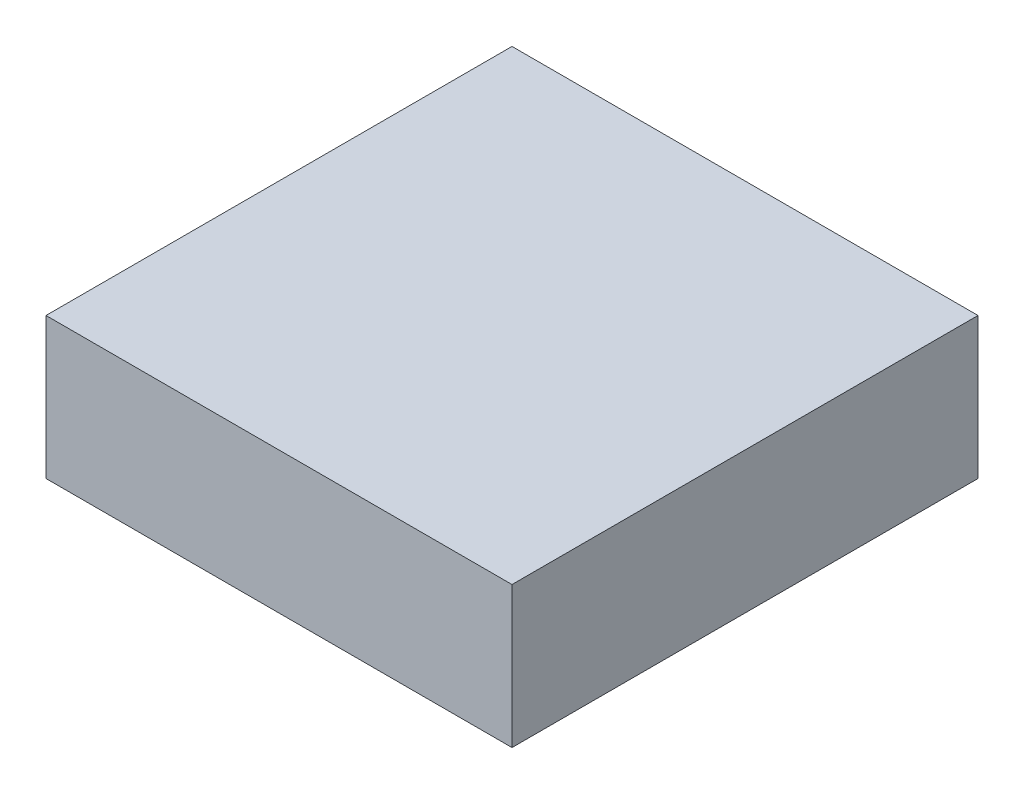
ISO-10303-21;
HEADER;
FILE_DESCRIPTION(('STEP AP214'),'2;1');
FILE_NAME('part.step','',(''),(''),'','','');
FILE_SCHEMA(('AUTOMOTIVE_DESIGN { 1 0 10303 214 1 1 1 1 }'));
ENDSEC;
DATA;
#1=APPLICATION_CONTEXT('core data for automotive mechanical design processes');
#2=APPLICATION_PROTOCOL_DEFINITION('international standard','automotive_design',2000,#1);
#3=PRODUCT_CONTEXT('',#1,'mechanical');
#4=PRODUCT('Part','Part','',(#3));
#5=PRODUCT_RELATED_PRODUCT_CATEGORY('part','',(#4));
#6=PRODUCT_DEFINITION_FORMATION('','',#4);
#7=PRODUCT_DEFINITION_CONTEXT('part definition',#1,'design');
#8=PRODUCT_DEFINITION('design','',#6,#7);
#9=PRODUCT_DEFINITION_SHAPE('','',#8);
#10=(LENGTH_UNIT() NAMED_UNIT(*) SI_UNIT(.MILLI.,.METRE.));
#11=(NAMED_UNIT(*) PLANE_ANGLE_UNIT() SI_UNIT($,.RADIAN.));
#12=(NAMED_UNIT(*) SI_UNIT($,.STERADIAN.) SOLID_ANGLE_UNIT());
#13=UNCERTAINTY_MEASURE_WITH_UNIT(LENGTH_MEASURE(1.E-05),#10,'distance_accuracy_value','');
#14=(GEOMETRIC_REPRESENTATION_CONTEXT(3) GLOBAL_UNCERTAINTY_ASSIGNED_CONTEXT((#13)) GLOBAL_UNIT_ASSIGNED_CONTEXT((#10,
#11,#12)) REPRESENTATION_CONTEXT('',''));
#15=CARTESIAN_POINT('',(0.,0.,0.));
#16=DIRECTION('',(0.,0.,1.));
#17=DIRECTION('',(1.,0.,0.));
#18=AXIS2_PLACEMENT_3D('',#15,#16,#17);
#19=CARTESIAN_POINT('',(20.85,-1.85,-18.025));
#20=DIRECTION('',(0.,-1.,0.));
#21=DIRECTION('',(1.,0.,0.));
#22=AXIS2_PLACEMENT_3D('',#19,#20,#21);
#23=PLANE('',#22);
#24=DIRECTION('',(1.,0.,0.));
#25=VECTOR('',#24,1.);
#26=CARTESIAN_POINT('',(22.5,-1.85,-14.725));
#27=LINE('',#26,#25);
#28=CARTESIAN_POINT('',(20.85,-1.85,-14.725));
#29=VERTEX_POINT('',#28);
#30=CARTESIAN_POINT('',(24.15,-1.85,-14.725));
#31=VERTEX_POINT('',#30);
#32=EDGE_CURVE('E54',#29,#31,#27,.T.);
#33=ORIENTED_EDGE('',*,*,#32,.F.);
#34=DIRECTION('',(0.,0.,1.));
#35=VECTOR('',#34,1.);
#36=CARTESIAN_POINT('',(20.85,-1.85,-16.375));
#37=LINE('',#36,#35);
#38=CARTESIAN_POINT('',(20.85,-1.85,-18.025));
#39=VERTEX_POINT('',#38);
#40=EDGE_CURVE('E69',#39,#29,#37,.T.);
#41=ORIENTED_EDGE('',*,*,#40,.F.);
#42=DIRECTION('',(-1.,0.,0.));
#43=VECTOR('',#42,1.);
#44=CARTESIAN_POINT('',(22.5,-1.85,-18.025));
#45=LINE('',#44,#43);
#46=CARTESIAN_POINT('',(24.15,-1.85,-18.025));
#47=VERTEX_POINT('',#46);
#48=EDGE_CURVE('E21',#47,#39,#45,.T.);
#49=ORIENTED_EDGE('',*,*,#48,.F.);
#50=DIRECTION('',(0.,0.,-1.));
#51=VECTOR('',#50,1.);
#52=CARTESIAN_POINT('',(24.15,-1.85,-16.375));
#53=LINE('',#52,#51);
#54=EDGE_CURVE('E59',#31,#47,#53,.T.);
#55=ORIENTED_EDGE('',*,*,#54,.F.);
#56=EDGE_LOOP('',(#33,#41,#49,#55));
#57=FACE_BOUND('',#56,.T.);
#58=ADVANCED_FACE('F17',(#57),#23,.T.);
#59=CARTESIAN_POINT('',(20.85,-0.85,-18.025));
#60=DIRECTION('',(0.,0.,-1.));
#61=DIRECTION('',(1.,0.,0.));
#62=AXIS2_PLACEMENT_3D('',#59,#60,#61);
#63=PLANE('',#62);
#64=ORIENTED_EDGE('',*,*,#48,.T.);
#65=DIRECTION('',(0.,-1.,0.));
#66=VECTOR('',#65,1.);
#67=CARTESIAN_POINT('',(20.85,-1.35,-18.025));
#68=LINE('',#67,#66);
#69=CARTESIAN_POINT('',(20.85,-0.85,-18.025));
#70=VERTEX_POINT('',#69);
#71=EDGE_CURVE('E80',#70,#39,#68,.T.);
#72=ORIENTED_EDGE('',*,*,#71,.F.);
#73=DIRECTION('',(1.,0.,0.));
#74=VECTOR('',#73,1.);
#75=CARTESIAN_POINT('',(22.5,-0.85,-18.025));
#76=LINE('',#75,#74);
#77=CARTESIAN_POINT('',(24.15,-0.85,-18.025));
#78=VERTEX_POINT('',#77);
#79=EDGE_CURVE('E75',#70,#78,#76,.T.);
#80=ORIENTED_EDGE('',*,*,#79,.T.);
#81=DIRECTION('',(0.,1.,0.));
#82=VECTOR('',#81,1.);
#83=CARTESIAN_POINT('',(24.15,-1.35,-18.025));
#84=LINE('',#83,#82);
#85=EDGE_CURVE('E64',#47,#78,#84,.T.);
#86=ORIENTED_EDGE('',*,*,#85,.F.);
#87=EDGE_LOOP('',(#64,#72,#80,#86));
#88=FACE_BOUND('',#87,.T.);
#89=ADVANCED_FACE('F74',(#88),#63,.T.);
#90=CARTESIAN_POINT('',(24.15,-0.85,-18.025));
#91=DIRECTION('',(1.,0.,0.));
#92=DIRECTION('',(0.,0.,1.));
#93=AXIS2_PLACEMENT_3D('',#90,#91,#92);
#94=PLANE('',#93);
#95=ORIENTED_EDGE('',*,*,#54,.T.);
#96=ORIENTED_EDGE('',*,*,#85,.T.);
#97=DIRECTION('',(0.,0.,1.));
#98=VECTOR('',#97,1.);
#99=CARTESIAN_POINT('',(24.15,-0.85,-16.375));
#100=LINE('',#99,#98);
#101=CARTESIAN_POINT('',(24.15,-0.85,-14.725));
#102=VERTEX_POINT('',#101);
#103=EDGE_CURVE('E85',#78,#102,#100,.T.);
#104=ORIENTED_EDGE('',*,*,#103,.T.);
#105=DIRECTION('',(0.,1.,0.));
#106=VECTOR('',#105,1.);
#107=CARTESIAN_POINT('',(24.15,-1.35,-14.725));
#108=LINE('',#107,#106);
#109=EDGE_CURVE('E66',#31,#102,#108,.T.);
#110=ORIENTED_EDGE('',*,*,#109,.F.);
#111=EDGE_LOOP('',(#95,#96,#104,#110));
#112=FACE_BOUND('',#111,.T.);
#113=ADVANCED_FACE('F61',(#112),#94,.T.);
#114=CARTESIAN_POINT('',(24.15,-0.85,-14.725));
#115=DIRECTION('',(0.,0.,1.));
#116=DIRECTION('',(-1.,0.,0.));
#117=AXIS2_PLACEMENT_3D('',#114,#115,#116);
#118=PLANE('',#117);
#119=ORIENTED_EDGE('',*,*,#32,.T.);
#120=ORIENTED_EDGE('',*,*,#109,.T.);
#121=DIRECTION('',(-1.,0.,0.));
#122=VECTOR('',#121,1.);
#123=CARTESIAN_POINT('',(22.5,-0.85,-14.725));
#124=LINE('',#123,#122);
#125=CARTESIAN_POINT('',(20.85,-0.85,-14.725));
#126=VERTEX_POINT('',#125);
#127=EDGE_CURVE('E27',#102,#126,#124,.T.);
#128=ORIENTED_EDGE('',*,*,#127,.T.);
#129=DIRECTION('',(0.,1.,0.));
#130=VECTOR('',#129,1.);
#131=CARTESIAN_POINT('',(20.85,-1.35,-14.725));
#132=LINE('',#131,#130);
#133=EDGE_CURVE('E35',#29,#126,#132,.T.);
#134=ORIENTED_EDGE('',*,*,#133,.F.);
#135=EDGE_LOOP('',(#119,#120,#128,#134));
#136=FACE_BOUND('',#135,.T.);
#137=ADVANCED_FACE('F89',(#136),#118,.T.);
#138=CARTESIAN_POINT('',(20.85,-0.85,-14.725));
#139=DIRECTION('',(-1.,0.,0.));
#140=DIRECTION('',(0.,0.,-1.));
#141=AXIS2_PLACEMENT_3D('',#138,#139,#140);
#142=PLANE('',#141);
#143=ORIENTED_EDGE('',*,*,#40,.T.);
#144=ORIENTED_EDGE('',*,*,#133,.T.);
#145=DIRECTION('',(0.,0.,-1.));
#146=VECTOR('',#145,1.);
#147=CARTESIAN_POINT('',(20.85,-0.85,-16.375));
#148=LINE('',#147,#146);
#149=EDGE_CURVE('E11',#126,#70,#148,.T.);
#150=ORIENTED_EDGE('',*,*,#149,.T.);
#151=ORIENTED_EDGE('',*,*,#71,.T.);
#152=EDGE_LOOP('',(#143,#144,#150,#151));
#153=FACE_BOUND('',#152,.T.);
#154=ADVANCED_FACE('F91',(#153),#142,.T.);
#155=CARTESIAN_POINT('',(20.85,-0.85,-18.025));
#156=DIRECTION('',(0.,-1.,0.));
#157=DIRECTION('',(1.,0.,0.));
#158=AXIS2_PLACEMENT_3D('',#155,#156,#157);
#159=PLANE('',#158);
#160=ORIENTED_EDGE('',*,*,#127,.F.);
#161=ORIENTED_EDGE('',*,*,#103,.F.);
#162=ORIENTED_EDGE('',*,*,#79,.F.);
#163=ORIENTED_EDGE('',*,*,#149,.F.);
#164=EDGE_LOOP('',(#160,#161,#162,#163));
#165=FACE_BOUND('',#164,.T.);
#166=ADVANCED_FACE('F19',(#165),#159,.F.);
#167=CLOSED_SHELL('',(#58,#89,#113,#137,#154,#166));
#168=MANIFOLD_SOLID_BREP('B1',#167);
#169=ADVANCED_BREP_SHAPE_REPRESENTATION('',(#18,#168),#14);
#170=SHAPE_DEFINITION_REPRESENTATION(#9,#169);
ENDSEC;
END-ISO-10303-21;
